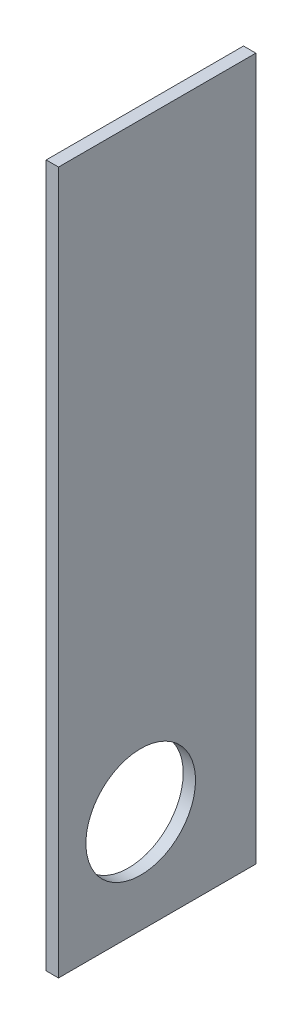
ISO-10303-21;
HEADER;
FILE_DESCRIPTION(('STEP AP214'),'2;1');
FILE_NAME('part.step','',(''),(''),'','','');
FILE_SCHEMA(('AUTOMOTIVE_DESIGN { 1 0 10303 214 1 1 1 1 }'));
ENDSEC;
DATA;
#1=APPLICATION_CONTEXT('core data for automotive mechanical design processes');
#2=APPLICATION_PROTOCOL_DEFINITION('international standard','automotive_design',2000,#1);
#3=PRODUCT_CONTEXT('',#1,'mechanical');
#4=PRODUCT('Part','Part','',(#3));
#5=PRODUCT_RELATED_PRODUCT_CATEGORY('part','',(#4));
#6=PRODUCT_DEFINITION_FORMATION('','',#4);
#7=PRODUCT_DEFINITION_CONTEXT('part definition',#1,'design');
#8=PRODUCT_DEFINITION('design','',#6,#7);
#9=PRODUCT_DEFINITION_SHAPE('','',#8);
#10=(LENGTH_UNIT() NAMED_UNIT(*) SI_UNIT(.MILLI.,.METRE.));
#11=(NAMED_UNIT(*) PLANE_ANGLE_UNIT() SI_UNIT($,.RADIAN.));
#12=(NAMED_UNIT(*) SI_UNIT($,.STERADIAN.) SOLID_ANGLE_UNIT());
#13=UNCERTAINTY_MEASURE_WITH_UNIT(LENGTH_MEASURE(1.E-05),#10,'distance_accuracy_value','');
#14=(GEOMETRIC_REPRESENTATION_CONTEXT(3) GLOBAL_UNCERTAINTY_ASSIGNED_CONTEXT((#13)) GLOBAL_UNIT_ASSIGNED_CONTEXT((#10,
#11,#12)) REPRESENTATION_CONTEXT('',''));
#15=CARTESIAN_POINT('',(0.,0.,0.));
#16=DIRECTION('',(0.,0.,1.));
#17=DIRECTION('',(1.,0.,0.));
#18=AXIS2_PLACEMENT_3D('',#15,#16,#17);
#19=CARTESIAN_POINT('',(18.,0.,0.));
#20=DIRECTION('',(1.,0.,0.));
#21=DIRECTION('',(0.,0.,-1.));
#22=AXIS2_PLACEMENT_3D('',#19,#20,#21);
#23=PLANE('',#22);
#24=DIRECTION('',(0.,-1.,0.));
#25=VECTOR('',#24,1.);
#26=CARTESIAN_POINT('',(18.,-676.121901091653,267.607933188847));
#27=LINE('',#26,#25);
#28=CARTESIAN_POINT('',(18.,57.7804435009756,267.607933188847));
#29=VERTEX_POINT('',#28);
#30=CARTESIAN_POINT('',(18.,-967.219556499024,267.607933188847));
#31=VERTEX_POINT('',#30);
#32=EDGE_CURVE('E77',#29,#31,#27,.T.);
#33=ORIENTED_EDGE('',*,*,#32,.T.);
#34=DIRECTION('',(0.,0.,-1.));
#35=VECTOR('',#34,1.);
#36=CARTESIAN_POINT('',(18.,-967.219556499024,-20.3920668111529));
#37=LINE('',#36,#35);
#38=CARTESIAN_POINT('',(18.,-967.219556499024,-20.3920668111529));
#39=VERTEX_POINT('',#38);
#40=EDGE_CURVE('E80',#31,#39,#37,.T.);
#41=ORIENTED_EDGE('',*,*,#40,.T.);
#42=DIRECTION('',(0.,1.,0.));
#43=VECTOR('',#42,1.);
#44=CARTESIAN_POINT('',(18.,-967.219556499024,-20.3920668111529));
#45=LINE('',#44,#43);
#46=CARTESIAN_POINT('',(18.,57.7804435009756,-20.3920668111529));
#47=VERTEX_POINT('',#46);
#48=EDGE_CURVE('E84',#39,#47,#45,.T.);
#49=ORIENTED_EDGE('',*,*,#48,.T.);
#50=DIRECTION('',(0.,0.,1.));
#51=VECTOR('',#50,1.);
#52=CARTESIAN_POINT('',(18.,57.7804435009756,-20.3920668111529));
#53=LINE('',#52,#51);
#54=EDGE_CURVE('E48',#47,#29,#53,.T.);
#55=ORIENTED_EDGE('',*,*,#54,.T.);
#56=EDGE_LOOP('',(#33,#41,#49,#55));
#57=FACE_BOUND('',#56,.T.);
#58=CARTESIAN_POINT('',(18.,-817.219556499024,147.607933188847));
#59=DIRECTION('',(1.,0.,0.));
#60=DIRECTION('',(0.,0.,-1.));
#61=AXIS2_PLACEMENT_3D('',#58,#59,#60);
#62=CIRCLE('',#61,80.);
#63=CARTESIAN_POINT('',(18.,-817.219556499024,67.607933188847));
#64=VERTEX_POINT('',#63);
#65=EDGE_CURVE('E97',#64,#64,#62,.T.);
#66=ORIENTED_EDGE('',*,*,#65,.F.);
#67=EDGE_LOOP('',(#66));
#68=FACE_BOUND('',#67,.T.);
#69=ADVANCED_FACE('F31',(#57,#68),#23,.T.);
#70=CARTESIAN_POINT('',(0.,0.,0.));
#71=DIRECTION('',(1.,0.,0.));
#72=DIRECTION('',(0.,0.,-1.));
#73=AXIS2_PLACEMENT_3D('',#70,#71,#72);
#74=PLANE('',#73);
#75=DIRECTION('',(0.,-1.,0.));
#76=VECTOR('',#75,1.);
#77=CARTESIAN_POINT('',(0.,-967.219556499024,267.607933188847));
#78=LINE('',#77,#76);
#79=CARTESIAN_POINT('',(0.,57.7804435009756,267.607933188847));
#80=VERTEX_POINT('',#79);
#81=CARTESIAN_POINT('',(0.,-967.219556499024,267.607933188847));
#82=VERTEX_POINT('',#81);
#83=EDGE_CURVE('E72',#80,#82,#78,.T.);
#84=ORIENTED_EDGE('',*,*,#83,.F.);
#85=DIRECTION('',(0.,0.,1.));
#86=VECTOR('',#85,1.);
#87=CARTESIAN_POINT('',(0.,57.7804435009756,-20.3920668111529));
#88=LINE('',#87,#86);
#89=CARTESIAN_POINT('',(0.,57.7804435009756,-20.3920668111529));
#90=VERTEX_POINT('',#89);
#91=EDGE_CURVE('E100',#90,#80,#88,.T.);
#92=ORIENTED_EDGE('',*,*,#91,.F.);
#93=DIRECTION('',(0.,1.,0.));
#94=VECTOR('',#93,1.);
#95=CARTESIAN_POINT('',(0.,-967.219556499024,-20.3920668111529));
#96=LINE('',#95,#94);
#97=CARTESIAN_POINT('',(0.,-967.219556499024,-20.3920668111529));
#98=VERTEX_POINT('',#97);
#99=EDGE_CURVE('E65',#98,#90,#96,.T.);
#100=ORIENTED_EDGE('',*,*,#99,.F.);
#101=DIRECTION('',(0.,0.,-1.));
#102=VECTOR('',#101,1.);
#103=CARTESIAN_POINT('',(0.,-967.219556499024,-20.3920668111529));
#104=LINE('',#103,#102);
#105=EDGE_CURVE('E88',#82,#98,#104,.T.);
#106=ORIENTED_EDGE('',*,*,#105,.F.);
#107=EDGE_LOOP('',(#84,#92,#100,#106));
#108=FACE_BOUND('',#107,.T.);
#109=CARTESIAN_POINT('',(0.,-817.219556499024,147.607933188847));
#110=DIRECTION('',(1.,0.,0.));
#111=DIRECTION('',(0.,0.,-1.));
#112=AXIS2_PLACEMENT_3D('',#109,#110,#111);
#113=CIRCLE('',#112,80.);
#114=CARTESIAN_POINT('',(0.,-817.219556499024,67.607933188847));
#115=VERTEX_POINT('',#114);
#116=EDGE_CURVE('E112',#115,#115,#113,.T.);
#117=ORIENTED_EDGE('',*,*,#116,.T.);
#118=EDGE_LOOP('',(#117));
#119=FACE_BOUND('',#118,.T.);
#120=ADVANCED_FACE('F106',(#108,#119),#74,.F.);
#121=CARTESIAN_POINT('',(18.,-967.219556499024,267.607933188847));
#122=DIRECTION('',(0.,0.,-1.));
#123=DIRECTION('',(-1.,0.,0.));
#124=AXIS2_PLACEMENT_3D('',#121,#122,#123);
#125=PLANE('',#124);
#126=ORIENTED_EDGE('',*,*,#83,.T.);
#127=DIRECTION('',(-1.,0.,0.));
#128=VECTOR('',#127,1.);
#129=CARTESIAN_POINT('',(18.,-967.219556499024,267.607933188847));
#130=LINE('',#129,#128);
#131=EDGE_CURVE('E11',#31,#82,#130,.T.);
#132=ORIENTED_EDGE('',*,*,#131,.F.);
#133=ORIENTED_EDGE('',*,*,#32,.F.);
#134=DIRECTION('',(-1.,0.,0.));
#135=VECTOR('',#134,1.);
#136=CARTESIAN_POINT('',(18.,57.7804435009756,267.607933188847));
#137=LINE('',#136,#135);
#138=EDGE_CURVE('E92',#29,#80,#137,.T.);
#139=ORIENTED_EDGE('',*,*,#138,.T.);
#140=EDGE_LOOP('',(#126,#132,#133,#139));
#141=FACE_BOUND('',#140,.T.);
#142=ADVANCED_FACE('F33',(#141),#125,.F.);
#143=CARTESIAN_POINT('',(18.,-967.219556499024,-20.3920668111529));
#144=DIRECTION('',(0.,1.,0.));
#145=DIRECTION('',(0.,0.,1.));
#146=AXIS2_PLACEMENT_3D('',#143,#144,#145);
#147=PLANE('',#146);
#148=ORIENTED_EDGE('',*,*,#105,.T.);
#149=DIRECTION('',(-1.,0.,0.));
#150=VECTOR('',#149,1.);
#151=CARTESIAN_POINT('',(18.,-967.219556499024,-20.3920668111529));
#152=LINE('',#151,#150);
#153=EDGE_CURVE('E40',#39,#98,#152,.T.);
#154=ORIENTED_EDGE('',*,*,#153,.F.);
#155=ORIENTED_EDGE('',*,*,#40,.F.);
#156=ORIENTED_EDGE('',*,*,#131,.T.);
#157=EDGE_LOOP('',(#148,#154,#155,#156));
#158=FACE_BOUND('',#157,.T.);
#159=ADVANCED_FACE('F87',(#158),#147,.F.);
#160=CARTESIAN_POINT('',(18.,-967.219556499024,-20.3920668111529));
#161=DIRECTION('',(0.,0.,1.));
#162=DIRECTION('',(1.,0.,0.));
#163=AXIS2_PLACEMENT_3D('',#160,#161,#162);
#164=PLANE('',#163);
#165=ORIENTED_EDGE('',*,*,#99,.T.);
#166=DIRECTION('',(-1.,0.,0.));
#167=VECTOR('',#166,1.);
#168=CARTESIAN_POINT('',(18.,57.7804435009756,-20.3920668111529));
#169=LINE('',#168,#167);
#170=EDGE_CURVE('E89',#47,#90,#169,.T.);
#171=ORIENTED_EDGE('',*,*,#170,.F.);
#172=ORIENTED_EDGE('',*,*,#48,.F.);
#173=ORIENTED_EDGE('',*,*,#153,.T.);
#174=EDGE_LOOP('',(#165,#171,#172,#173));
#175=FACE_BOUND('',#174,.T.);
#176=ADVANCED_FACE('F90',(#175),#164,.F.);
#177=CARTESIAN_POINT('',(18.,57.7804435009756,-20.3920668111529));
#178=DIRECTION('',(0.,-1.,0.));
#179=DIRECTION('',(0.,0.,-1.));
#180=AXIS2_PLACEMENT_3D('',#177,#178,#179);
#181=PLANE('',#180);
#182=ORIENTED_EDGE('',*,*,#91,.T.);
#183=ORIENTED_EDGE('',*,*,#138,.F.);
#184=ORIENTED_EDGE('',*,*,#54,.F.);
#185=ORIENTED_EDGE('',*,*,#170,.T.);
#186=EDGE_LOOP('',(#182,#183,#184,#185));
#187=FACE_BOUND('',#186,.T.);
#188=ADVANCED_FACE('F105',(#187),#181,.F.);
#189=CARTESIAN_POINT('',(18.,-817.219556499024,147.607933188847));
#190=DIRECTION('',(-1.,0.,0.));
#191=DIRECTION('',(0.,0.,1.));
#192=AXIS2_PLACEMENT_3D('',#189,#190,#191);
#193=CYLINDRICAL_SURFACE('',#192,80.);
#194=ORIENTED_EDGE('',*,*,#65,.T.);
#195=EDGE_LOOP('',(#194));
#196=FACE_BOUND('',#195,.T.);
#197=ORIENTED_EDGE('',*,*,#116,.F.);
#198=EDGE_LOOP('',(#197));
#199=FACE_BOUND('',#198,.T.);
#200=ADVANCED_FACE('F119',(#196,#199),#193,.F.);
#201=CLOSED_SHELL('',(#69,#120,#142,#159,#176,#188,#200));
#202=MANIFOLD_SOLID_BREP('B2',#201);
#203=ADVANCED_BREP_SHAPE_REPRESENTATION('',(#18,#202),#14);
#204=SHAPE_DEFINITION_REPRESENTATION(#9,#203);
ENDSEC;
END-ISO-10303-21;
